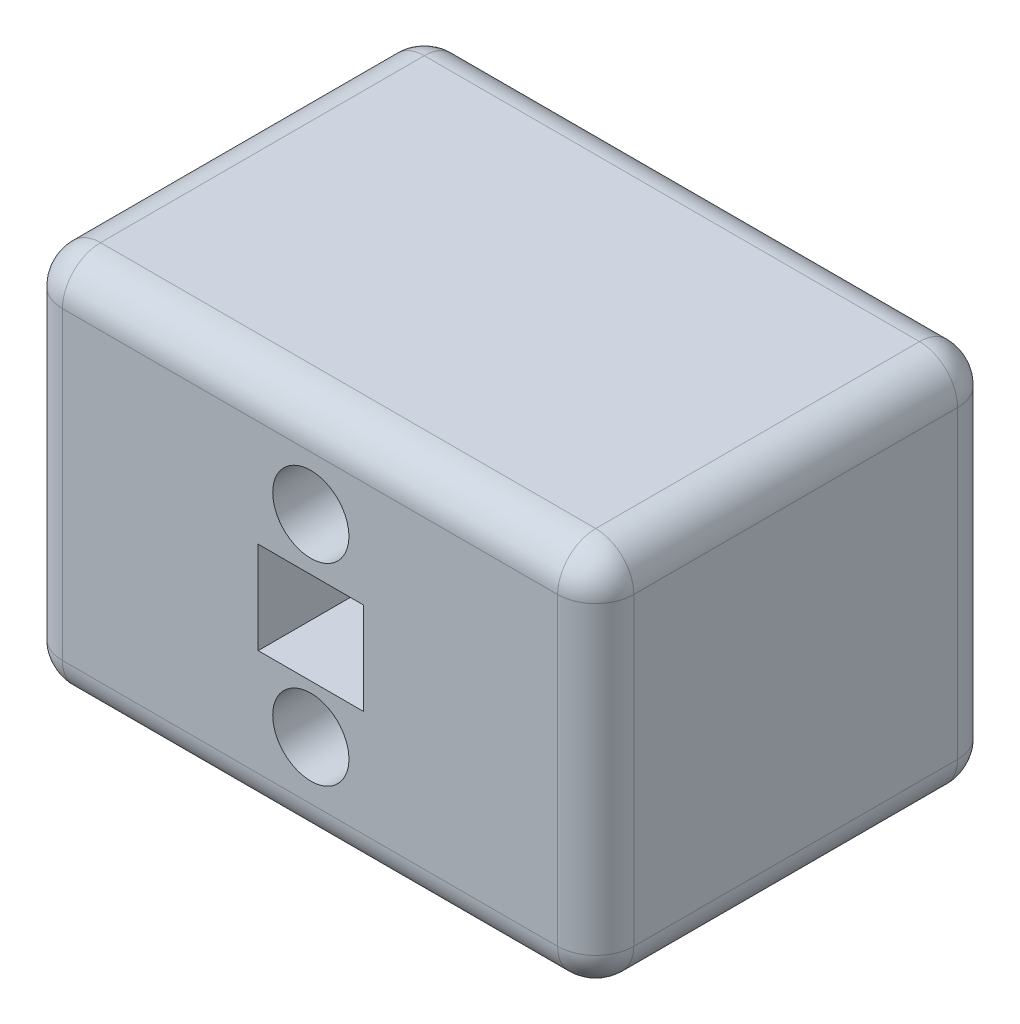
ISO-10303-21;
HEADER;
FILE_DESCRIPTION(('STEP AP214'),'2;1');
FILE_NAME('part.step','',(''),(''),'','','');
FILE_SCHEMA(('AUTOMOTIVE_DESIGN { 1 0 10303 214 1 1 1 1 }'));
ENDSEC;
DATA;
#1=APPLICATION_CONTEXT('core data for automotive mechanical design processes');
#2=APPLICATION_PROTOCOL_DEFINITION('international standard','automotive_design',2000,#1);
#3=PRODUCT_CONTEXT('',#1,'mechanical');
#4=PRODUCT('Part','Part','',(#3));
#5=PRODUCT_RELATED_PRODUCT_CATEGORY('part','',(#4));
#6=PRODUCT_DEFINITION_FORMATION('','',#4);
#7=PRODUCT_DEFINITION_CONTEXT('part definition',#1,'design');
#8=PRODUCT_DEFINITION('design','',#6,#7);
#9=PRODUCT_DEFINITION_SHAPE('','',#8);
#10=(LENGTH_UNIT() NAMED_UNIT(*) SI_UNIT(.MILLI.,.METRE.));
#11=(NAMED_UNIT(*) PLANE_ANGLE_UNIT() SI_UNIT($,.RADIAN.));
#12=(NAMED_UNIT(*) SI_UNIT($,.STERADIAN.) SOLID_ANGLE_UNIT());
#13=UNCERTAINTY_MEASURE_WITH_UNIT(LENGTH_MEASURE(1.E-05),#10,'distance_accuracy_value','');
#14=(GEOMETRIC_REPRESENTATION_CONTEXT(3) GLOBAL_UNCERTAINTY_ASSIGNED_CONTEXT((#13)) GLOBAL_UNIT_ASSIGNED_CONTEXT((#10,
#11,#12)) REPRESENTATION_CONTEXT('',''));
#15=CARTESIAN_POINT('',(0.,0.,0.));
#16=DIRECTION('',(0.,0.,1.));
#17=DIRECTION('',(1.,0.,0.));
#18=AXIS2_PLACEMENT_3D('',#15,#16,#17);
#19=CARTESIAN_POINT('',(0.,0.,60.));
#20=DIRECTION('',(0.,0.,-1.));
#21=DIRECTION('',(-1.,0.,0.));
#22=AXIS2_PLACEMENT_3D('',#19,#20,#21);
#23=PLANE('',#22);
#24=CARTESIAN_POINT('',(75.205896989788,75.8190774456008,60.));
#25=DIRECTION('',(0.,0.,-1.));
#26=DIRECTION('',(-1.,0.,0.));
#27=AXIS2_PLACEMENT_3D('',#24,#25,#26);
#28=CIRCLE('',#27,9.99999999999999);
#29=CARTESIAN_POINT('',(65.205896989788,75.8190774456008,60.));
#30=VERTEX_POINT('',#29);
#31=EDGE_CURVE('E271',#30,#30,#28,.T.);
#32=ORIENTED_EDGE('',*,*,#31,.T.);
#33=EDGE_LOOP('',(#32));
#34=FACE_BOUND('',#33,.T.);
#35=CARTESIAN_POINT('',(75.205896989788,25.1739639946146,60.));
#36=DIRECTION('',(0.,0.,-1.));
#37=DIRECTION('',(-1.,0.,0.));
#38=AXIS2_PLACEMENT_3D('',#35,#36,#37);
#39=CIRCLE('',#38,9.99999999999999);
#40=CARTESIAN_POINT('',(65.205896989788,25.1739639946146,60.));
#41=VERTEX_POINT('',#40);
#42=EDGE_CURVE('E358',#41,#41,#39,.T.);
#43=ORIENTED_EDGE('',*,*,#42,.T.);
#44=EDGE_LOOP('',(#43));
#45=FACE_BOUND('',#44,.T.);
#46=DIRECTION('',(0.,-1.,0.));
#47=VECTOR('',#46,1.);
#48=CARTESIAN_POINT('',(10.,0.,60.));
#49=LINE('',#48,#47);
#50=CARTESIAN_POINT('',(9.99999999999935,90.0000000000001,60.));
#51=VERTEX_POINT('',#50);
#52=CARTESIAN_POINT('',(9.99999999999993,10.,60.));
#53=VERTEX_POINT('',#52);
#54=EDGE_CURVE('E259',#51,#53,#49,.T.);
#55=ORIENTED_EDGE('',*,*,#54,.T.);
#56=DIRECTION('',(1.,0.,0.));
#57=VECTOR('',#56,1.);
#58=CARTESIAN_POINT('',(0.,10.,60.));
#59=LINE('',#58,#57);
#60=CARTESIAN_POINT('',(139.999999999999,10.,60.));
#61=VERTEX_POINT('',#60);
#62=EDGE_CURVE('E11',#53,#61,#59,.T.);
#63=ORIENTED_EDGE('',*,*,#62,.T.);
#64=DIRECTION('',(0.,1.,0.));
#65=VECTOR('',#64,1.);
#66=CARTESIAN_POINT('',(139.999999999999,0.,60.));
#67=LINE('',#66,#65);
#68=CARTESIAN_POINT('',(139.999999999999,90.,60.));
#69=VERTEX_POINT('',#68);
#70=EDGE_CURVE('E51',#61,#69,#67,.T.);
#71=ORIENTED_EDGE('',*,*,#70,.T.);
#72=DIRECTION('',(-1.,0.,0.));
#73=VECTOR('',#72,1.);
#74=CARTESIAN_POINT('',(0.,90.0000000000001,60.));
#75=LINE('',#74,#73);
#76=EDGE_CURVE('E262',#69,#51,#75,.T.);
#77=ORIENTED_EDGE('',*,*,#76,.T.);
#78=EDGE_LOOP('',(#55,#63,#71,#77));
#79=FACE_BOUND('',#78,.T.);
#80=DIRECTION('',(0.,-1.,0.));
#81=VECTOR('',#80,1.);
#82=CARTESIAN_POINT('',(61.3909381303206,0.,60.));
#83=LINE('',#82,#81);
#84=CARTESIAN_POINT('',(61.3909381303206,62.131744481496,60.));
#85=VERTEX_POINT('',#84);
#86=CARTESIAN_POINT('',(61.3909381303206,37.9287933013438,60.));
#87=VERTEX_POINT('',#86);
#88=EDGE_CURVE('E170',#85,#87,#83,.T.);
#89=ORIENTED_EDGE('',*,*,#88,.F.);
#90=DIRECTION('',(-1.,0.,0.));
#91=VECTOR('',#90,1.);
#92=CARTESIAN_POINT('',(0.,62.131744481496,60.));
#93=LINE('',#92,#91);
#94=CARTESIAN_POINT('',(89.0208558492554,62.131744481496,60.));
#95=VERTEX_POINT('',#94);
#96=EDGE_CURVE('E380',#95,#85,#93,.T.);
#97=ORIENTED_EDGE('',*,*,#96,.F.);
#98=DIRECTION('',(0.,1.,0.));
#99=VECTOR('',#98,1.);
#100=CARTESIAN_POINT('',(89.0208558492554,0.,60.));
#101=LINE('',#100,#99);
#102=CARTESIAN_POINT('',(89.0208558492554,37.9287933013438,60.));
#103=VERTEX_POINT('',#102);
#104=EDGE_CURVE('E177',#103,#95,#101,.T.);
#105=ORIENTED_EDGE('',*,*,#104,.F.);
#106=DIRECTION('',(1.,0.,0.));
#107=VECTOR('',#106,1.);
#108=CARTESIAN_POINT('',(0.,37.9287933013438,60.));
#109=LINE('',#108,#107);
#110=EDGE_CURVE('E385',#87,#103,#109,.T.);
#111=ORIENTED_EDGE('',*,*,#110,.F.);
#112=EDGE_LOOP('',(#89,#97,#105,#111));
#113=FACE_BOUND('',#112,.T.);
#114=ADVANCED_FACE('F41',(#34,#45,#79,#113),#23,.F.);
#115=CARTESIAN_POINT('',(0.,0.,-45.));
#116=DIRECTION('',(0.,0.,-1.));
#117=DIRECTION('',(-1.,0.,0.));
#118=AXIS2_PLACEMENT_3D('',#115,#116,#117);
#119=PLANE('',#118);
#120=CARTESIAN_POINT('',(75.205896989788,75.8190774456008,-45.));
#121=DIRECTION('',(0.,0.,-1.));
#122=DIRECTION('',(-1.,0.,0.));
#123=AXIS2_PLACEMENT_3D('',#120,#121,#122);
#124=CIRCLE('',#123,9.99999999999999);
#125=CARTESIAN_POINT('',(65.205896989788,75.8190774456008,-45.));
#126=VERTEX_POINT('',#125);
#127=EDGE_CURVE('E45',#126,#126,#124,.T.);
#128=ORIENTED_EDGE('',*,*,#127,.F.);
#129=EDGE_LOOP('',(#128));
#130=FACE_BOUND('',#129,.T.);
#131=CARTESIAN_POINT('',(75.205896989788,25.1739639946146,-45.));
#132=DIRECTION('',(0.,0.,-1.));
#133=DIRECTION('',(-1.,0.,0.));
#134=AXIS2_PLACEMENT_3D('',#131,#132,#133);
#135=CIRCLE('',#134,9.99999999999999);
#136=CARTESIAN_POINT('',(65.205896989788,25.1739639946146,-45.));
#137=VERTEX_POINT('',#136);
#138=EDGE_CURVE('E355',#137,#137,#135,.T.);
#139=ORIENTED_EDGE('',*,*,#138,.F.);
#140=EDGE_LOOP('',(#139));
#141=FACE_BOUND('',#140,.T.);
#142=DIRECTION('',(0.,1.,0.));
#143=VECTOR('',#142,1.);
#144=CARTESIAN_POINT('',(139.999999999999,0.,-45.));
#145=LINE('',#144,#143);
#146=CARTESIAN_POINT('',(139.999999999999,90.,-45.));
#147=VERTEX_POINT('',#146);
#148=CARTESIAN_POINT('',(139.999999999999,10.,-45.));
#149=VERTEX_POINT('',#148);
#150=EDGE_CURVE('E213',#147,#149,#145,.F.);
#151=ORIENTED_EDGE('',*,*,#150,.T.);
#152=DIRECTION('',(1.,0.,0.));
#153=VECTOR('',#152,1.);
#154=CARTESIAN_POINT('',(0.,10.,-45.));
#155=LINE('',#154,#153);
#156=CARTESIAN_POINT('',(9.99999999999993,10.,-45.));
#157=VERTEX_POINT('',#156);
#158=EDGE_CURVE('E216',#149,#157,#155,.F.);
#159=ORIENTED_EDGE('',*,*,#158,.T.);
#160=DIRECTION('',(0.,-1.,0.));
#161=VECTOR('',#160,1.);
#162=CARTESIAN_POINT('',(9.99999999999927,100.,-45.));
#163=LINE('',#162,#161);
#164=CARTESIAN_POINT('',(9.99999999999935,90.0000000000001,-45.));
#165=VERTEX_POINT('',#164);
#166=EDGE_CURVE('E207',#157,#165,#163,.F.);
#167=ORIENTED_EDGE('',*,*,#166,.T.);
#168=DIRECTION('',(-1.,0.,0.));
#169=VECTOR('',#168,1.);
#170=CARTESIAN_POINT('',(149.999999999999,90.,-45.));
#171=LINE('',#170,#169);
#172=EDGE_CURVE('E210',#165,#147,#171,.F.);
#173=ORIENTED_EDGE('',*,*,#172,.T.);
#174=EDGE_LOOP('',(#151,#159,#167,#173));
#175=FACE_BOUND('',#174,.T.);
#176=DIRECTION('',(-1.,0.,0.));
#177=VECTOR('',#176,1.);
#178=CARTESIAN_POINT('',(0.,62.131744481496,-45.));
#179=LINE('',#178,#177);
#180=CARTESIAN_POINT('',(89.0208558492554,62.131744481496,-45.));
#181=VERTEX_POINT('',#180);
#182=CARTESIAN_POINT('',(61.3909381303206,62.131744481496,-45.));
#183=VERTEX_POINT('',#182);
#184=EDGE_CURVE('E157',#181,#183,#179,.T.);
#185=ORIENTED_EDGE('',*,*,#184,.T.);
#186=DIRECTION('',(0.,-1.,0.));
#187=VECTOR('',#186,1.);
#188=CARTESIAN_POINT('',(61.3909381303206,0.,-45.));
#189=LINE('',#188,#187);
#190=CARTESIAN_POINT('',(61.3909381303206,37.9287933013438,-45.));
#191=VERTEX_POINT('',#190);
#192=EDGE_CURVE('E188',#183,#191,#189,.T.);
#193=ORIENTED_EDGE('',*,*,#192,.T.);
#194=DIRECTION('',(1.,0.,0.));
#195=VECTOR('',#194,1.);
#196=CARTESIAN_POINT('',(0.,37.9287933013438,-45.));
#197=LINE('',#196,#195);
#198=CARTESIAN_POINT('',(89.0208558492554,37.9287933013438,-45.));
#199=VERTEX_POINT('',#198);
#200=EDGE_CURVE('E184',#191,#199,#197,.T.);
#201=ORIENTED_EDGE('',*,*,#200,.T.);
#202=DIRECTION('',(0.,1.,0.));
#203=VECTOR('',#202,1.);
#204=CARTESIAN_POINT('',(89.0208558492554,0.,-45.));
#205=LINE('',#204,#203);
#206=EDGE_CURVE('E169',#199,#181,#205,.T.);
#207=ORIENTED_EDGE('',*,*,#206,.T.);
#208=EDGE_LOOP('',(#185,#193,#201,#207));
#209=FACE_BOUND('',#208,.T.);
#210=ADVANCED_FACE('F183',(#130,#141,#175,#209),#119,.T.);
#211=CARTESIAN_POINT('',(149.999999999999,0.,60.));
#212=DIRECTION('',(0.,1.,0.));
#213=DIRECTION('',(-1.,0.,0.));
#214=AXIS2_PLACEMENT_3D('',#211,#212,#213);
#215=PLANE('',#214);
#216=DIRECTION('',(1.,0.,0.));
#217=VECTOR('',#216,1.);
#218=CARTESIAN_POINT('',(149.999999999999,0.,50.));
#219=LINE('',#218,#217);
#220=CARTESIAN_POINT('',(139.999999999999,0.,50.));
#221=VERTEX_POINT('',#220);
#222=CARTESIAN_POINT('',(9.99999999999993,0.,50.));
#223=VERTEX_POINT('',#222);
#224=EDGE_CURVE('E197',#221,#223,#219,.F.);
#225=ORIENTED_EDGE('',*,*,#224,.T.);
#226=DIRECTION('',(0.,0.,-1.));
#227=VECTOR('',#226,1.);
#228=CARTESIAN_POINT('',(9.99999999999993,0.,60.));
#229=LINE('',#228,#227);
#230=CARTESIAN_POINT('',(9.99999999999993,0.,-35.));
#231=VERTEX_POINT('',#230);
#232=EDGE_CURVE('E204',#223,#231,#229,.T.);
#233=ORIENTED_EDGE('',*,*,#232,.T.);
#234=DIRECTION('',(1.,0.,0.));
#235=VECTOR('',#234,1.);
#236=CARTESIAN_POINT('',(149.999999999999,0.,-35.));
#237=LINE('',#236,#235);
#238=CARTESIAN_POINT('',(139.999999999999,0.,-35.));
#239=VERTEX_POINT('',#238);
#240=EDGE_CURVE('E200',#231,#239,#237,.T.);
#241=ORIENTED_EDGE('',*,*,#240,.T.);
#242=DIRECTION('',(0.,0.,-1.));
#243=VECTOR('',#242,1.);
#244=CARTESIAN_POINT('',(139.999999999999,0.,60.));
#245=LINE('',#244,#243);
#246=EDGE_CURVE('E194',#239,#221,#245,.F.);
#247=ORIENTED_EDGE('',*,*,#246,.T.);
#248=EDGE_LOOP('',(#225,#233,#241,#247));
#249=FACE_BOUND('',#248,.T.);
#250=ADVANCED_FACE('F402',(#249),#215,.F.);
#251=CARTESIAN_POINT('',(149.999999999999,100.,60.));
#252=DIRECTION('',(-1.,0.,0.));
#253=DIRECTION('',(0.,0.,1.));
#254=AXIS2_PLACEMENT_3D('',#251,#252,#253);
#255=PLANE('',#254);
#256=DIRECTION('',(0.,1.,0.));
#257=VECTOR('',#256,1.);
#258=CARTESIAN_POINT('',(149.999999999999,100.,-35.));
#259=LINE('',#258,#257);
#260=CARTESIAN_POINT('',(149.999999999999,9.99999999999999,-35.));
#261=VERTEX_POINT('',#260);
#262=CARTESIAN_POINT('',(149.999999999999,90.,-35.));
#263=VERTEX_POINT('',#262);
#264=EDGE_CURVE('E226',#261,#263,#259,.T.);
#265=ORIENTED_EDGE('',*,*,#264,.T.);
#266=DIRECTION('',(0.,0.,-1.));
#267=VECTOR('',#266,1.);
#268=CARTESIAN_POINT('',(149.999999999999,90.,60.));
#269=LINE('',#268,#267);
#270=CARTESIAN_POINT('',(149.999999999999,90.,50.));
#271=VERTEX_POINT('',#270);
#272=EDGE_CURVE('E230',#263,#271,#269,.F.);
#273=ORIENTED_EDGE('',*,*,#272,.T.);
#274=DIRECTION('',(0.,1.,0.));
#275=VECTOR('',#274,1.);
#276=CARTESIAN_POINT('',(149.999999999999,100.,50.));
#277=LINE('',#276,#275);
#278=CARTESIAN_POINT('',(149.999999999999,9.99999999999999,50.));
#279=VERTEX_POINT('',#278);
#280=EDGE_CURVE('E223',#271,#279,#277,.F.);
#281=ORIENTED_EDGE('',*,*,#280,.T.);
#282=DIRECTION('',(0.,0.,-1.));
#283=VECTOR('',#282,1.);
#284=CARTESIAN_POINT('',(149.999999999999,9.99999999999999,60.));
#285=LINE('',#284,#283);
#286=EDGE_CURVE('E220',#279,#261,#285,.T.);
#287=ORIENTED_EDGE('',*,*,#286,.T.);
#288=EDGE_LOOP('',(#265,#273,#281,#287));
#289=FACE_BOUND('',#288,.T.);
#290=ADVANCED_FACE('F414',(#289),#255,.F.);
#291=CARTESIAN_POINT('',(-7.25114412958305E-13,100.,60.));
#292=DIRECTION('',(0.,-1.,0.));
#293=DIRECTION('',(1.,0.,0.));
#294=AXIS2_PLACEMENT_3D('',#291,#292,#293);
#295=PLANE('',#294);
#296=DIRECTION('',(-1.,0.,0.));
#297=VECTOR('',#296,1.);
#298=CARTESIAN_POINT('',(-7.25114412958305E-13,100.,-35.));
#299=LINE('',#298,#297);
#300=CARTESIAN_POINT('',(139.999999999999,100.,-35.));
#301=VERTEX_POINT('',#300);
#302=CARTESIAN_POINT('',(9.99999999999936,100.,-35.));
#303=VERTEX_POINT('',#302);
#304=EDGE_CURVE('E239',#301,#303,#299,.T.);
#305=ORIENTED_EDGE('',*,*,#304,.T.);
#306=DIRECTION('',(0.,0.,-1.));
#307=VECTOR('',#306,1.);
#308=CARTESIAN_POINT('',(9.99999999999936,100.,60.));
#309=LINE('',#308,#307);
#310=CARTESIAN_POINT('',(9.99999999999936,100.,50.));
#311=VERTEX_POINT('',#310);
#312=EDGE_CURVE('E243',#303,#311,#309,.F.);
#313=ORIENTED_EDGE('',*,*,#312,.T.);
#314=DIRECTION('',(-1.,0.,0.));
#315=VECTOR('',#314,1.);
#316=CARTESIAN_POINT('',(-7.25114412958305E-13,100.,50.));
#317=LINE('',#316,#315);
#318=CARTESIAN_POINT('',(139.999999999999,100.,50.));
#319=VERTEX_POINT('',#318);
#320=EDGE_CURVE('E236',#311,#319,#317,.F.);
#321=ORIENTED_EDGE('',*,*,#320,.T.);
#322=DIRECTION('',(0.,0.,-1.));
#323=VECTOR('',#322,1.);
#324=CARTESIAN_POINT('',(139.999999999999,100.,60.));
#325=LINE('',#324,#323);
#326=EDGE_CURVE('E233',#319,#301,#325,.T.);
#327=ORIENTED_EDGE('',*,*,#326,.T.);
#328=EDGE_LOOP('',(#305,#313,#321,#327));
#329=FACE_BOUND('',#328,.T.);
#330=ADVANCED_FACE('F410',(#329),#295,.F.);
#331=CARTESIAN_POINT('',(0.,0.,60.));
#332=DIRECTION('',(1.,0.,0.));
#333=DIRECTION('',(0.,1.,0.));
#334=AXIS2_PLACEMENT_3D('',#331,#332,#333);
#335=PLANE('',#334);
#336=DIRECTION('',(0.,-1.,0.));
#337=VECTOR('',#336,1.);
#338=CARTESIAN_POINT('',(0.,0.,-35.));
#339=LINE('',#338,#337);
#340=CARTESIAN_POINT('',(-6.52602971662474E-13,90.,-35.));
#341=VERTEX_POINT('',#340);
#342=CARTESIAN_POINT('',(0.,9.99999999999993,-35.));
#343=VERTEX_POINT('',#342);
#344=EDGE_CURVE('E252',#341,#343,#339,.T.);
#345=ORIENTED_EDGE('',*,*,#344,.T.);
#346=DIRECTION('',(0.,0.,-1.));
#347=VECTOR('',#346,1.);
#348=CARTESIAN_POINT('',(0.,9.99999999999993,60.));
#349=LINE('',#348,#347);
#350=CARTESIAN_POINT('',(0.,9.99999999999993,50.));
#351=VERTEX_POINT('',#350);
#352=EDGE_CURVE('E256',#343,#351,#349,.F.);
#353=ORIENTED_EDGE('',*,*,#352,.T.);
#354=DIRECTION('',(0.,-1.,0.));
#355=VECTOR('',#354,1.);
#356=CARTESIAN_POINT('',(0.,0.,50.));
#357=LINE('',#356,#355);
#358=CARTESIAN_POINT('',(-6.52602971662474E-13,90.,50.));
#359=VERTEX_POINT('',#358);
#360=EDGE_CURVE('E249',#351,#359,#357,.F.);
#361=ORIENTED_EDGE('',*,*,#360,.T.);
#362=DIRECTION('',(0.,0.,-1.));
#363=VECTOR('',#362,1.);
#364=CARTESIAN_POINT('',(-6.52602971662474E-13,90.,60.));
#365=LINE('',#364,#363);
#366=EDGE_CURVE('E246',#359,#341,#365,.T.);
#367=ORIENTED_EDGE('',*,*,#366,.T.);
#368=EDGE_LOOP('',(#345,#353,#361,#367));
#369=FACE_BOUND('',#368,.T.);
#370=ADVANCED_FACE('F407',(#369),#335,.F.);
#371=CARTESIAN_POINT('',(61.3909381303206,62.131744481496,79.));
#372=DIRECTION('',(1.,0.,0.));
#373=DIRECTION('',(0.,0.,-1.));
#374=AXIS2_PLACEMENT_3D('',#371,#372,#373);
#375=PLANE('',#374);
#376=ORIENTED_EDGE('',*,*,#88,.T.);
#377=DIRECTION('',(0.,0.,-1.));
#378=VECTOR('',#377,1.);
#379=CARTESIAN_POINT('',(61.3909381303206,37.9287933013438,79.));
#380=LINE('',#379,#378);
#381=EDGE_CURVE('E376',#87,#191,#380,.T.);
#382=ORIENTED_EDGE('',*,*,#381,.T.);
#383=ORIENTED_EDGE('',*,*,#192,.F.);
#384=DIRECTION('',(0.,0.,-1.));
#385=VECTOR('',#384,1.);
#386=CARTESIAN_POINT('',(61.3909381303206,62.131744481496,79.));
#387=LINE('',#386,#385);
#388=EDGE_CURVE('E163',#85,#183,#387,.T.);
#389=ORIENTED_EDGE('',*,*,#388,.F.);
#390=EDGE_LOOP('',(#376,#382,#383,#389));
#391=FACE_BOUND('',#390,.T.);
#392=ADVANCED_FACE('F391',(#391),#375,.T.);
#393=CARTESIAN_POINT('',(61.3909381303206,37.9287933013438,79.));
#394=DIRECTION('',(0.,1.,0.));
#395=DIRECTION('',(0.,0.,1.));
#396=AXIS2_PLACEMENT_3D('',#393,#394,#395);
#397=PLANE('',#396);
#398=ORIENTED_EDGE('',*,*,#110,.T.);
#399=DIRECTION('',(0.,0.,-1.));
#400=VECTOR('',#399,1.);
#401=CARTESIAN_POINT('',(89.0208558492554,37.9287933013438,79.));
#402=LINE('',#401,#400);
#403=EDGE_CURVE('E180',#103,#199,#402,.T.);
#404=ORIENTED_EDGE('',*,*,#403,.T.);
#405=ORIENTED_EDGE('',*,*,#200,.F.);
#406=ORIENTED_EDGE('',*,*,#381,.F.);
#407=EDGE_LOOP('',(#398,#404,#405,#406));
#408=FACE_BOUND('',#407,.T.);
#409=ADVANCED_FACE('F395',(#408),#397,.T.);
#410=CARTESIAN_POINT('',(89.0208558492554,62.131744481496,79.));
#411=DIRECTION('',(-1.,0.,0.));
#412=DIRECTION('',(0.,0.,1.));
#413=AXIS2_PLACEMENT_3D('',#410,#411,#412);
#414=PLANE('',#413);
#415=ORIENTED_EDGE('',*,*,#104,.T.);
#416=DIRECTION('',(0.,0.,-1.));
#417=VECTOR('',#416,1.);
#418=CARTESIAN_POINT('',(89.0208558492554,62.131744481496,79.));
#419=LINE('',#418,#417);
#420=EDGE_CURVE('E160',#95,#181,#419,.T.);
#421=ORIENTED_EDGE('',*,*,#420,.T.);
#422=ORIENTED_EDGE('',*,*,#206,.F.);
#423=ORIENTED_EDGE('',*,*,#403,.F.);
#424=EDGE_LOOP('',(#415,#421,#422,#423));
#425=FACE_BOUND('',#424,.T.);
#426=ADVANCED_FACE('F173',(#425),#414,.T.);
#427=CARTESIAN_POINT('',(61.3909381303206,62.131744481496,79.));
#428=DIRECTION('',(0.,-1.,0.));
#429=DIRECTION('',(0.,0.,-1.));
#430=AXIS2_PLACEMENT_3D('',#427,#428,#429);
#431=PLANE('',#430);
#432=ORIENTED_EDGE('',*,*,#96,.T.);
#433=ORIENTED_EDGE('',*,*,#388,.T.);
#434=ORIENTED_EDGE('',*,*,#184,.F.);
#435=ORIENTED_EDGE('',*,*,#420,.F.);
#436=EDGE_LOOP('',(#432,#433,#434,#435));
#437=FACE_BOUND('',#436,.T.);
#438=ADVANCED_FACE('F159',(#437),#431,.T.);
#439=CARTESIAN_POINT('',(0.,90.0000000000001,50.));
#440=DIRECTION('',(-1.,0.,0.));
#441=DIRECTION('',(0.,-1.,0.));
#442=AXIS2_PLACEMENT_3D('',#439,#440,#441);
#443=CYLINDRICAL_SURFACE('',#442,10.);
#444=CARTESIAN_POINT('',(9.99999999999935,90.0000000000001,50.));
#445=DIRECTION('',(-1.,0.,0.));
#446=DIRECTION('',(0.,-1.,0.));
#447=AXIS2_PLACEMENT_3D('',#444,#445,#446);
#448=CIRCLE('',#447,10.);
#449=EDGE_CURVE('E352',#51,#311,#448,.T.);
#450=ORIENTED_EDGE('',*,*,#449,.F.);
#451=ORIENTED_EDGE('',*,*,#76,.F.);
#452=CARTESIAN_POINT('',(139.999999999999,90.,50.));
#453=DIRECTION('',(1.,0.,0.));
#454=DIRECTION('',(0.,0.,-1.));
#455=AXIS2_PLACEMENT_3D('',#452,#453,#454);
#456=CIRCLE('',#455,10.);
#457=EDGE_CURVE('E348',#319,#69,#456,.T.);
#458=ORIENTED_EDGE('',*,*,#457,.F.);
#459=ORIENTED_EDGE('',*,*,#320,.F.);
#460=EDGE_LOOP('',(#450,#451,#458,#459));
#461=FACE_BOUND('',#460,.T.);
#462=ADVANCED_FACE('F43',(#461),#443,.T.);
#463=CARTESIAN_POINT('',(9.99999999999935,90.0000000000001,50.));
#464=DIRECTION('',(0.,1.,0.));
#465=DIRECTION('',(-1.,0.,0.));
#466=AXIS2_PLACEMENT_3D('',#463,#464,#465);
#467=SPHERICAL_SURFACE('',#466,10.);
#468=CARTESIAN_POINT('',(9.99999999999935,90.0000000000001,50.));
#469=DIRECTION('',(0.,1.,0.));
#470=DIRECTION('',(-1.,0.,0.));
#471=AXIS2_PLACEMENT_3D('',#468,#469,#470);
#472=CIRCLE('',#471,10.);
#473=EDGE_CURVE('E340',#51,#359,#472,.F.);
#474=ORIENTED_EDGE('',*,*,#473,.F.);
#475=ORIENTED_EDGE('',*,*,#449,.T.);
#476=CARTESIAN_POINT('',(9.99999999999935,90.0000000000001,50.));
#477=DIRECTION('',(0.,0.,1.));
#478=DIRECTION('',(1.,0.,0.));
#479=AXIS2_PLACEMENT_3D('',#476,#477,#478);
#480=CIRCLE('',#479,10.);
#481=EDGE_CURVE('E344',#359,#311,#480,.F.);
#482=ORIENTED_EDGE('',*,*,#481,.F.);
#483=EDGE_LOOP('',(#474,#475,#482));
#484=FACE_BOUND('',#483,.T.);
#485=ADVANCED_FACE('F492',(#484),#467,.T.);
#486=CARTESIAN_POINT('',(139.999999999999,90.,50.));
#487=DIRECTION('',(0.,0.,1.));
#488=DIRECTION('',(1.,0.,0.));
#489=AXIS2_PLACEMENT_3D('',#486,#487,#488);
#490=SPHERICAL_SURFACE('',#489,10.);
#491=CARTESIAN_POINT('',(139.999999999999,90.,50.));
#492=DIRECTION('',(0.,0.,1.));
#493=DIRECTION('',(1.,0.,0.));
#494=AXIS2_PLACEMENT_3D('',#491,#492,#493);
#495=CIRCLE('',#494,10.);
#496=EDGE_CURVE('E332',#319,#271,#495,.F.);
#497=ORIENTED_EDGE('',*,*,#496,.F.);
#498=ORIENTED_EDGE('',*,*,#457,.T.);
#499=CARTESIAN_POINT('',(139.999999999999,90.,50.));
#500=DIRECTION('',(0.,1.,0.));
#501=DIRECTION('',(0.,0.,1.));
#502=AXIS2_PLACEMENT_3D('',#499,#500,#501);
#503=CIRCLE('',#502,10.);
#504=EDGE_CURVE('E336',#271,#69,#503,.F.);
#505=ORIENTED_EDGE('',*,*,#504,.F.);
#506=EDGE_LOOP('',(#497,#498,#505));
#507=FACE_BOUND('',#506,.T.);
#508=ADVANCED_FACE('F489',(#507),#490,.T.);
#509=CARTESIAN_POINT('',(9.99999999999935,90.0000000000001,60.));
#510=DIRECTION('',(0.,0.,-1.));
#511=DIRECTION('',(-1.,0.,0.));
#512=AXIS2_PLACEMENT_3D('',#509,#510,#511);
#513=CYLINDRICAL_SURFACE('',#512,10.);
#514=ORIENTED_EDGE('',*,*,#481,.T.);
#515=ORIENTED_EDGE('',*,*,#312,.F.);
#516=CARTESIAN_POINT('',(9.99999999999935,90.0000000000001,-35.));
#517=DIRECTION('',(0.,0.,-1.));
#518=DIRECTION('',(-1.,0.,0.));
#519=AXIS2_PLACEMENT_3D('',#516,#517,#518);
#520=CIRCLE('',#519,10.);
#521=EDGE_CURVE('E325',#341,#303,#520,.T.);
#522=ORIENTED_EDGE('',*,*,#521,.F.);
#523=ORIENTED_EDGE('',*,*,#366,.F.);
#524=EDGE_LOOP('',(#514,#515,#522,#523));
#525=FACE_BOUND('',#524,.T.);
#526=ADVANCED_FACE('F485',(#525),#513,.T.);
#527=CARTESIAN_POINT('',(10.,0.,50.));
#528=DIRECTION('',(0.,-1.,0.));
#529=DIRECTION('',(1.,0.,0.));
#530=AXIS2_PLACEMENT_3D('',#527,#528,#529);
#531=CYLINDRICAL_SURFACE('',#530,10.);
#532=ORIENTED_EDGE('',*,*,#473,.T.);
#533=ORIENTED_EDGE('',*,*,#360,.F.);
#534=CARTESIAN_POINT('',(9.99999999999993,10.,50.));
#535=DIRECTION('',(0.,-1.,0.));
#536=DIRECTION('',(1.,0.,0.));
#537=AXIS2_PLACEMENT_3D('',#534,#535,#536);
#538=CIRCLE('',#537,10.);
#539=EDGE_CURVE('E321',#53,#351,#538,.T.);
#540=ORIENTED_EDGE('',*,*,#539,.F.);
#541=ORIENTED_EDGE('',*,*,#54,.F.);
#542=EDGE_LOOP('',(#532,#533,#540,#541));
#543=FACE_BOUND('',#542,.T.);
#544=ADVANCED_FACE('F481',(#543),#531,.T.);
#545=CARTESIAN_POINT('',(0.,10.,50.));
#546=DIRECTION('',(1.,0.,0.));
#547=DIRECTION('',(0.,1.,0.));
#548=AXIS2_PLACEMENT_3D('',#545,#546,#547);
#549=CYLINDRICAL_SURFACE('',#548,10.);
#550=CARTESIAN_POINT('',(139.999999999999,10.,50.));
#551=DIRECTION('',(1.,0.,0.));
#552=DIRECTION('',(0.,0.,-1.));
#553=AXIS2_PLACEMENT_3D('',#550,#551,#552);
#554=CIRCLE('',#553,10.);
#555=EDGE_CURVE('E314',#61,#221,#554,.T.);
#556=ORIENTED_EDGE('',*,*,#555,.F.);
#557=ORIENTED_EDGE('',*,*,#62,.F.);
#558=CARTESIAN_POINT('',(9.99999999999993,10.,50.));
#559=DIRECTION('',(-1.,0.,0.));
#560=DIRECTION('',(0.,0.,1.));
#561=AXIS2_PLACEMENT_3D('',#558,#559,#560);
#562=CIRCLE('',#561,10.);
#563=EDGE_CURVE('E317',#223,#53,#562,.T.);
#564=ORIENTED_EDGE('',*,*,#563,.F.);
#565=ORIENTED_EDGE('',*,*,#224,.F.);
#566=EDGE_LOOP('',(#556,#557,#564,#565));
#567=FACE_BOUND('',#566,.T.);
#568=ADVANCED_FACE('F477',(#567),#549,.T.);
#569=CARTESIAN_POINT('',(139.999999999999,0.,50.));
#570=DIRECTION('',(0.,1.,0.));
#571=DIRECTION('',(0.,0.,1.));
#572=AXIS2_PLACEMENT_3D('',#569,#570,#571);
#573=CYLINDRICAL_SURFACE('',#572,10.);
#574=ORIENTED_EDGE('',*,*,#504,.T.);
#575=ORIENTED_EDGE('',*,*,#70,.F.);
#576=CARTESIAN_POINT('',(139.999999999999,9.99999999999999,50.));
#577=DIRECTION('',(0.,-1.,0.));
#578=DIRECTION('',(0.,0.,-1.));
#579=AXIS2_PLACEMENT_3D('',#576,#577,#578);
#580=CIRCLE('',#579,10.);
#581=EDGE_CURVE('E59',#279,#61,#580,.T.);
#582=ORIENTED_EDGE('',*,*,#581,.F.);
#583=ORIENTED_EDGE('',*,*,#280,.F.);
#584=EDGE_LOOP('',(#574,#575,#582,#583));
#585=FACE_BOUND('',#584,.T.);
#586=ADVANCED_FACE('F473',(#585),#573,.T.);
#587=CARTESIAN_POINT('',(139.999999999999,90.,60.));
#588=DIRECTION('',(0.,0.,-1.));
#589=DIRECTION('',(-1.,0.,0.));
#590=AXIS2_PLACEMENT_3D('',#587,#588,#589);
#591=CYLINDRICAL_SURFACE('',#590,10.);
#592=ORIENTED_EDGE('',*,*,#496,.T.);
#593=ORIENTED_EDGE('',*,*,#272,.F.);
#594=CARTESIAN_POINT('',(139.999999999999,90.,-35.));
#595=DIRECTION('',(0.,0.,-1.));
#596=DIRECTION('',(-1.,0.,0.));
#597=AXIS2_PLACEMENT_3D('',#594,#595,#596);
#598=CIRCLE('',#597,10.);
#599=EDGE_CURVE('E308',#301,#263,#598,.T.);
#600=ORIENTED_EDGE('',*,*,#599,.F.);
#601=ORIENTED_EDGE('',*,*,#326,.F.);
#602=EDGE_LOOP('',(#592,#593,#600,#601));
#603=FACE_BOUND('',#602,.T.);
#604=ADVANCED_FACE('F469',(#603),#591,.T.);
#605=CARTESIAN_POINT('',(-7.33441085642994E-13,90.0000000000001,-35.));
#606=DIRECTION('',(1.,0.,0.));
#607=DIRECTION('',(0.,1.,0.));
#608=AXIS2_PLACEMENT_3D('',#605,#606,#607);
#609=CYLINDRICAL_SURFACE('',#608,10.);
#610=CARTESIAN_POINT('',(9.99999999999935,90.0000000000001,-35.));
#611=DIRECTION('',(-1.,0.,0.));
#612=DIRECTION('',(0.,-1.,0.));
#613=AXIS2_PLACEMENT_3D('',#610,#611,#612);
#614=CIRCLE('',#613,10.);
#615=EDGE_CURVE('E328',#303,#165,#614,.T.);
#616=ORIENTED_EDGE('',*,*,#615,.F.);
#617=ORIENTED_EDGE('',*,*,#304,.F.);
#618=CARTESIAN_POINT('',(139.999999999999,90.,-35.));
#619=DIRECTION('',(1.,0.,0.));
#620=DIRECTION('',(0.,0.,-1.));
#621=AXIS2_PLACEMENT_3D('',#618,#619,#620);
#622=CIRCLE('',#621,10.);
#623=EDGE_CURVE('E304',#147,#301,#622,.T.);
#624=ORIENTED_EDGE('',*,*,#623,.F.);
#625=ORIENTED_EDGE('',*,*,#172,.F.);
#626=EDGE_LOOP('',(#616,#617,#624,#625));
#627=FACE_BOUND('',#626,.T.);
#628=ADVANCED_FACE('F465',(#627),#609,.T.);
#629=CARTESIAN_POINT('',(9.99999999999935,90.0000000000001,-35.));
#630=DIRECTION('',(0.,1.,0.));
#631=DIRECTION('',(-1.,0.,0.));
#632=AXIS2_PLACEMENT_3D('',#629,#630,#631);
#633=SPHERICAL_SURFACE('',#632,10.);
#634=ORIENTED_EDGE('',*,*,#521,.T.);
#635=ORIENTED_EDGE('',*,*,#615,.T.);
#636=CARTESIAN_POINT('',(9.99999999999935,90.0000000000001,-35.));
#637=DIRECTION('',(0.,1.,0.));
#638=DIRECTION('',(-1.,0.,0.));
#639=AXIS2_PLACEMENT_3D('',#636,#637,#638);
#640=CIRCLE('',#639,10.);
#641=EDGE_CURVE('E300',#341,#165,#640,.F.);
#642=ORIENTED_EDGE('',*,*,#641,.F.);
#643=EDGE_LOOP('',(#634,#635,#642));
#644=FACE_BOUND('',#643,.T.);
#645=ADVANCED_FACE('F461',(#644),#633,.T.);
#646=CARTESIAN_POINT('',(9.99999999999993,10.,50.));
#647=DIRECTION('',(0.,0.,1.));
#648=DIRECTION('',(1.,0.,0.));
#649=AXIS2_PLACEMENT_3D('',#646,#647,#648);
#650=SPHERICAL_SURFACE('',#649,10.);
#651=ORIENTED_EDGE('',*,*,#563,.T.);
#652=ORIENTED_EDGE('',*,*,#539,.T.);
#653=CARTESIAN_POINT('',(9.99999999999993,10.,50.));
#654=DIRECTION('',(0.,0.,1.));
#655=DIRECTION('',(1.,0.,0.));
#656=AXIS2_PLACEMENT_3D('',#653,#654,#655);
#657=CIRCLE('',#656,10.);
#658=EDGE_CURVE('E296',#223,#351,#657,.F.);
#659=ORIENTED_EDGE('',*,*,#658,.F.);
#660=EDGE_LOOP('',(#651,#652,#659));
#661=FACE_BOUND('',#660,.T.);
#662=ADVANCED_FACE('F458',(#661),#650,.T.);
#663=CARTESIAN_POINT('',(139.999999999999,10.,50.));
#664=DIRECTION('',(0.,0.,1.));
#665=DIRECTION('',(1.,0.,0.));
#666=AXIS2_PLACEMENT_3D('',#663,#664,#665);
#667=SPHERICAL_SURFACE('',#666,10.);
#668=ORIENTED_EDGE('',*,*,#581,.T.);
#669=ORIENTED_EDGE('',*,*,#555,.T.);
#670=CARTESIAN_POINT('',(139.999999999999,10.,50.));
#671=DIRECTION('',(0.,0.,1.));
#672=DIRECTION('',(1.,0.,0.));
#673=AXIS2_PLACEMENT_3D('',#670,#671,#672);
#674=CIRCLE('',#673,10.);
#675=EDGE_CURVE('E292',#279,#221,#674,.F.);
#676=ORIENTED_EDGE('',*,*,#675,.F.);
#677=EDGE_LOOP('',(#668,#669,#676));
#678=FACE_BOUND('',#677,.T.);
#679=ADVANCED_FACE('F454',(#678),#667,.T.);
#680=CARTESIAN_POINT('',(139.999999999999,90.,-35.));
#681=DIRECTION('',(0.,1.,0.));
#682=DIRECTION('',(0.,0.,1.));
#683=AXIS2_PLACEMENT_3D('',#680,#681,#682);
#684=SPHERICAL_SURFACE('',#683,10.);
#685=ORIENTED_EDGE('',*,*,#623,.T.);
#686=ORIENTED_EDGE('',*,*,#599,.T.);
#687=CARTESIAN_POINT('',(139.999999999999,90.,-35.));
#688=DIRECTION('',(0.,1.,0.));
#689=DIRECTION('',(0.,0.,1.));
#690=AXIS2_PLACEMENT_3D('',#687,#688,#689);
#691=CIRCLE('',#690,10.);
#692=EDGE_CURVE('E289',#147,#263,#691,.F.);
#693=ORIENTED_EDGE('',*,*,#692,.F.);
#694=EDGE_LOOP('',(#685,#686,#693));
#695=FACE_BOUND('',#694,.T.);
#696=ADVANCED_FACE('F450',(#695),#684,.T.);
#697=CARTESIAN_POINT('',(10.,0.,-35.));
#698=DIRECTION('',(0.,1.,0.));
#699=DIRECTION('',(-1.,0.,0.));
#700=AXIS2_PLACEMENT_3D('',#697,#698,#699);
#701=CYLINDRICAL_SURFACE('',#700,10.);
#702=ORIENTED_EDGE('',*,*,#641,.T.);
#703=ORIENTED_EDGE('',*,*,#166,.F.);
#704=CARTESIAN_POINT('',(9.99999999999993,10.,-35.));
#705=DIRECTION('',(0.,-1.,0.));
#706=DIRECTION('',(1.,0.,0.));
#707=AXIS2_PLACEMENT_3D('',#704,#705,#706);
#708=CIRCLE('',#707,10.);
#709=EDGE_CURVE('E285',#343,#157,#708,.T.);
#710=ORIENTED_EDGE('',*,*,#709,.F.);
#711=ORIENTED_EDGE('',*,*,#344,.F.);
#712=EDGE_LOOP('',(#702,#703,#710,#711));
#713=FACE_BOUND('',#712,.T.);
#714=ADVANCED_FACE('F446',(#713),#701,.T.);
#715=CARTESIAN_POINT('',(9.99999999999993,10.,60.));
#716=DIRECTION('',(0.,0.,-1.));
#717=DIRECTION('',(-1.,0.,0.));
#718=AXIS2_PLACEMENT_3D('',#715,#716,#717);
#719=CYLINDRICAL_SURFACE('',#718,10.);
#720=ORIENTED_EDGE('',*,*,#658,.T.);
#721=ORIENTED_EDGE('',*,*,#352,.F.);
#722=CARTESIAN_POINT('',(9.99999999999993,10.,-35.));
#723=DIRECTION('',(0.,0.,-1.));
#724=DIRECTION('',(-1.,0.,0.));
#725=AXIS2_PLACEMENT_3D('',#722,#723,#724);
#726=CIRCLE('',#725,10.);
#727=EDGE_CURVE('E282',#231,#343,#726,.T.);
#728=ORIENTED_EDGE('',*,*,#727,.F.);
#729=ORIENTED_EDGE('',*,*,#232,.F.);
#730=EDGE_LOOP('',(#720,#721,#728,#729));
#731=FACE_BOUND('',#730,.T.);
#732=ADVANCED_FACE('F442',(#731),#719,.T.);
#733=CARTESIAN_POINT('',(139.999999999999,9.99999999999999,60.));
#734=DIRECTION('',(0.,0.,-1.));
#735=DIRECTION('',(-1.,0.,0.));
#736=AXIS2_PLACEMENT_3D('',#733,#734,#735);
#737=CYLINDRICAL_SURFACE('',#736,10.);
#738=ORIENTED_EDGE('',*,*,#675,.T.);
#739=ORIENTED_EDGE('',*,*,#246,.F.);
#740=CARTESIAN_POINT('',(139.999999999999,9.99999999999999,-35.));
#741=DIRECTION('',(0.,0.,-1.));
#742=DIRECTION('',(-1.,0.,0.));
#743=AXIS2_PLACEMENT_3D('',#740,#741,#742);
#744=CIRCLE('',#743,10.);
#745=EDGE_CURVE('E278',#261,#239,#744,.T.);
#746=ORIENTED_EDGE('',*,*,#745,.F.);
#747=ORIENTED_EDGE('',*,*,#286,.F.);
#748=EDGE_LOOP('',(#738,#739,#746,#747));
#749=FACE_BOUND('',#748,.T.);
#750=ADVANCED_FACE('F438',(#749),#737,.T.);
#751=CARTESIAN_POINT('',(139.999999999999,100.,-35.));
#752=DIRECTION('',(0.,-1.,0.));
#753=DIRECTION('',(0.,0.,-1.));
#754=AXIS2_PLACEMENT_3D('',#751,#752,#753);
#755=CYLINDRICAL_SURFACE('',#754,10.);
#756=ORIENTED_EDGE('',*,*,#692,.T.);
#757=ORIENTED_EDGE('',*,*,#264,.F.);
#758=CARTESIAN_POINT('',(139.999999999999,10.,-35.));
#759=DIRECTION('',(0.,-1.,0.));
#760=DIRECTION('',(1.,0.,0.));
#761=AXIS2_PLACEMENT_3D('',#758,#759,#760);
#762=CIRCLE('',#761,10.);
#763=EDGE_CURVE('E274',#149,#261,#762,.T.);
#764=ORIENTED_EDGE('',*,*,#763,.F.);
#765=ORIENTED_EDGE('',*,*,#150,.F.);
#766=EDGE_LOOP('',(#756,#757,#764,#765));
#767=FACE_BOUND('',#766,.T.);
#768=ADVANCED_FACE('F434',(#767),#755,.T.);
#769=CARTESIAN_POINT('',(9.99999999999993,10.,-35.));
#770=DIRECTION('',(-1.,0.,0.));
#771=DIRECTION('',(0.,-1.,0.));
#772=AXIS2_PLACEMENT_3D('',#769,#770,#771);
#773=SPHERICAL_SURFACE('',#772,10.);
#774=ORIENTED_EDGE('',*,*,#727,.T.);
#775=ORIENTED_EDGE('',*,*,#709,.T.);
#776=CARTESIAN_POINT('',(9.99999999999993,10.,-35.));
#777=DIRECTION('',(-1.,0.,0.));
#778=DIRECTION('',(0.,0.,1.));
#779=AXIS2_PLACEMENT_3D('',#776,#777,#778);
#780=CIRCLE('',#779,10.);
#781=EDGE_CURVE('E270',#231,#157,#780,.F.);
#782=ORIENTED_EDGE('',*,*,#781,.F.);
#783=EDGE_LOOP('',(#774,#775,#782));
#784=FACE_BOUND('',#783,.T.);
#785=ADVANCED_FACE('F430',(#784),#773,.T.);
#786=CARTESIAN_POINT('',(139.999999999999,10.,-35.));
#787=DIRECTION('',(1.,0.,0.));
#788=DIRECTION('',(0.,0.,-1.));
#789=AXIS2_PLACEMENT_3D('',#786,#787,#788);
#790=SPHERICAL_SURFACE('',#789,10.);
#791=ORIENTED_EDGE('',*,*,#763,.T.);
#792=ORIENTED_EDGE('',*,*,#745,.T.);
#793=CARTESIAN_POINT('',(139.999999999999,10.,-35.));
#794=DIRECTION('',(1.,0.,0.));
#795=DIRECTION('',(0.,0.,-1.));
#796=AXIS2_PLACEMENT_3D('',#793,#794,#795);
#797=CIRCLE('',#796,10.);
#798=EDGE_CURVE('E267',#149,#239,#797,.F.);
#799=ORIENTED_EDGE('',*,*,#798,.F.);
#800=EDGE_LOOP('',(#791,#792,#799));
#801=FACE_BOUND('',#800,.T.);
#802=ADVANCED_FACE('F426',(#801),#790,.T.);
#803=CARTESIAN_POINT('',(149.999999999999,10.,-35.));
#804=DIRECTION('',(-1.,0.,0.));
#805=DIRECTION('',(0.,-1.,0.));
#806=AXIS2_PLACEMENT_3D('',#803,#804,#805);
#807=CYLINDRICAL_SURFACE('',#806,10.);
#808=ORIENTED_EDGE('',*,*,#781,.T.);
#809=ORIENTED_EDGE('',*,*,#158,.F.);
#810=ORIENTED_EDGE('',*,*,#798,.T.);
#811=ORIENTED_EDGE('',*,*,#240,.F.);
#812=EDGE_LOOP('',(#808,#809,#810,#811));
#813=FACE_BOUND('',#812,.T.);
#814=ADVANCED_FACE('F422',(#813),#807,.T.);
#815=CARTESIAN_POINT('',(75.205896989788,25.1739639946146,-125.));
#816=DIRECTION('',(0.,0.,1.));
#817=DIRECTION('',(1.,0.,0.));
#818=AXIS2_PLACEMENT_3D('',#815,#816,#817);
#819=CYLINDRICAL_SURFACE('',#818,9.99999999999999);
#820=ORIENTED_EDGE('',*,*,#138,.T.);
#821=EDGE_LOOP('',(#820));
#822=FACE_BOUND('',#821,.T.);
#823=ORIENTED_EDGE('',*,*,#42,.F.);
#824=EDGE_LOOP('',(#823));
#825=FACE_BOUND('',#824,.T.);
#826=ADVANCED_FACE('F425',(#822,#825),#819,.F.);
#827=CARTESIAN_POINT('',(75.205896989788,75.8190774456008,-125.));
#828=DIRECTION('',(0.,0.,1.));
#829=DIRECTION('',(1.,0.,0.));
#830=AXIS2_PLACEMENT_3D('',#827,#828,#829);
#831=CYLINDRICAL_SURFACE('',#830,9.99999999999999);
#832=ORIENTED_EDGE('',*,*,#127,.T.);
#833=EDGE_LOOP('',(#832));
#834=FACE_BOUND('',#833,.T.);
#835=ORIENTED_EDGE('',*,*,#31,.F.);
#836=EDGE_LOOP('',(#835));
#837=FACE_BOUND('',#836,.T.);
#838=ADVANCED_FACE('F738',(#834,#837),#831,.F.);
#839=CLOSED_SHELL('',(#114,#210,#250,#290,#330,#370,#392,#409,#426,#438,#462,#485,#508,#526,
#544,#568,#586,#604,#628,#645,#662,#679,#696,#714,#732,#750,#768,#785,#802,#814,#826,#838));
#840=MANIFOLD_SOLID_BREP('B2',#839);
#841=ADVANCED_BREP_SHAPE_REPRESENTATION('',(#18,#840),#14);
#842=SHAPE_DEFINITION_REPRESENTATION(#9,#841);
ENDSEC;
END-ISO-10303-21;
